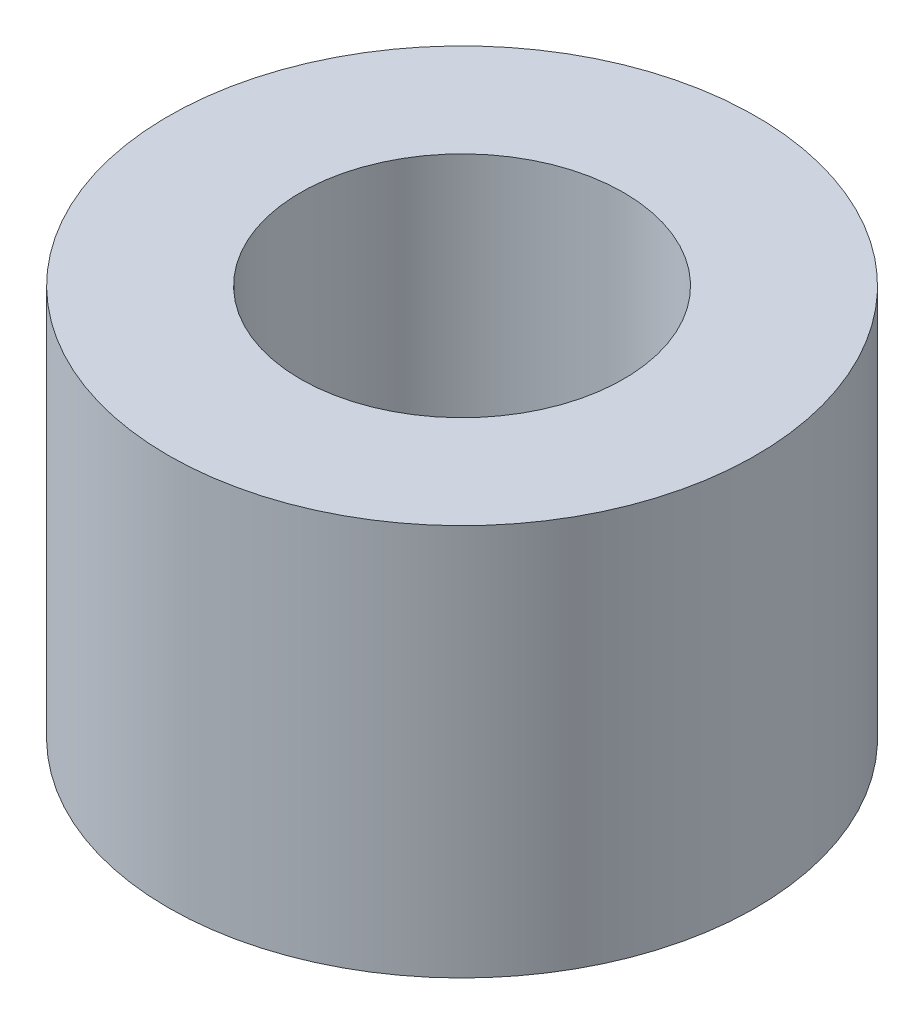
ISO-10303-21;
HEADER;
FILE_DESCRIPTION(('STEP AP214'),'2;1');
FILE_NAME('part.step','',(''),(''),'','','');
FILE_SCHEMA(('AUTOMOTIVE_DESIGN { 1 0 10303 214 1 1 1 1 }'));
ENDSEC;
DATA;
#1=APPLICATION_CONTEXT('core data for automotive mechanical design processes');
#2=APPLICATION_PROTOCOL_DEFINITION('international standard','automotive_design',2000,#1);
#3=PRODUCT_CONTEXT('',#1,'mechanical');
#4=PRODUCT('Part','Part','',(#3));
#5=PRODUCT_RELATED_PRODUCT_CATEGORY('part','',(#4));
#6=PRODUCT_DEFINITION_FORMATION('','',#4);
#7=PRODUCT_DEFINITION_CONTEXT('part definition',#1,'design');
#8=PRODUCT_DEFINITION('design','',#6,#7);
#9=PRODUCT_DEFINITION_SHAPE('','',#8);
#10=(LENGTH_UNIT() NAMED_UNIT(*) SI_UNIT(.MILLI.,.METRE.));
#11=(NAMED_UNIT(*) PLANE_ANGLE_UNIT() SI_UNIT($,.RADIAN.));
#12=(NAMED_UNIT(*) SI_UNIT($,.STERADIAN.) SOLID_ANGLE_UNIT());
#13=UNCERTAINTY_MEASURE_WITH_UNIT(LENGTH_MEASURE(1.E-05),#10,'distance_accuracy_value','');
#14=(GEOMETRIC_REPRESENTATION_CONTEXT(3) GLOBAL_UNCERTAINTY_ASSIGNED_CONTEXT((#13)) GLOBAL_UNIT_ASSIGNED_CONTEXT((#10,
#11,#12)) REPRESENTATION_CONTEXT('',''));
#15=CARTESIAN_POINT('',(0.,0.,0.));
#16=DIRECTION('',(0.,0.,1.));
#17=DIRECTION('',(1.,0.,0.));
#18=AXIS2_PLACEMENT_3D('',#15,#16,#17);
#19=CARTESIAN_POINT('',(0.,4.,0.));
#20=DIRECTION('',(0.,1.,0.));
#21=DIRECTION('',(0.,0.,1.));
#22=AXIS2_PLACEMENT_3D('',#19,#20,#21);
#23=PLANE('',#22);
#24=CARTESIAN_POINT('',(0.,4.,0.));
#25=DIRECTION('',(0.,1.,0.));
#26=DIRECTION('',(0.,0.,1.));
#27=AXIS2_PLACEMENT_3D('',#24,#25,#26);
#28=CIRCLE('',#27,3.);
#29=CARTESIAN_POINT('',(0.,4.,3.));
#30=VERTEX_POINT('',#29);
#31=EDGE_CURVE('E10',#30,#30,#28,.T.);
#32=ORIENTED_EDGE('',*,*,#31,.T.);
#33=EDGE_LOOP('',(#32));
#34=FACE_BOUND('',#33,.T.);
#35=CARTESIAN_POINT('',(0.,4.,0.));
#36=DIRECTION('',(0.,1.,0.));
#37=DIRECTION('',(0.,0.,1.));
#38=AXIS2_PLACEMENT_3D('',#35,#36,#37);
#39=CIRCLE('',#38,1.65);
#40=CARTESIAN_POINT('',(0.,4.,1.65));
#41=VERTEX_POINT('',#40);
#42=EDGE_CURVE('E51',#41,#41,#39,.T.);
#43=ORIENTED_EDGE('',*,*,#42,.F.);
#44=EDGE_LOOP('',(#43));
#45=FACE_BOUND('',#44,.T.);
#46=ADVANCED_FACE('F39',(#34,#45),#23,.T.);
#47=CARTESIAN_POINT('',(0.,0.,0.));
#48=DIRECTION('',(0.,1.,0.));
#49=DIRECTION('',(0.,0.,1.));
#50=AXIS2_PLACEMENT_3D('',#47,#48,#49);
#51=PLANE('',#50);
#52=CARTESIAN_POINT('',(0.,0.,0.));
#53=DIRECTION('',(0.,1.,0.));
#54=DIRECTION('',(0.,0.,1.));
#55=AXIS2_PLACEMENT_3D('',#52,#53,#54);
#56=CIRCLE('',#55,3.);
#57=CARTESIAN_POINT('',(0.,0.,3.));
#58=VERTEX_POINT('',#57);
#59=EDGE_CURVE('E43',#58,#58,#56,.T.);
#60=ORIENTED_EDGE('',*,*,#59,.F.);
#61=EDGE_LOOP('',(#60));
#62=FACE_BOUND('',#61,.T.);
#63=CARTESIAN_POINT('',(0.,0.,0.));
#64=DIRECTION('',(0.,1.,0.));
#65=DIRECTION('',(0.,0.,1.));
#66=AXIS2_PLACEMENT_3D('',#63,#64,#65);
#67=CIRCLE('',#66,1.65);
#68=CARTESIAN_POINT('',(0.,0.,1.65));
#69=VERTEX_POINT('',#68);
#70=EDGE_CURVE('E53',#69,#69,#67,.T.);
#71=ORIENTED_EDGE('',*,*,#70,.T.);
#72=EDGE_LOOP('',(#71));
#73=FACE_BOUND('',#72,.T.);
#74=ADVANCED_FACE('F63',(#62,#73),#51,.F.);
#75=CARTESIAN_POINT('',(0.,4.,0.));
#76=DIRECTION('',(0.,-1.,0.));
#77=DIRECTION('',(0.,0.,-1.));
#78=AXIS2_PLACEMENT_3D('',#75,#76,#77);
#79=CYLINDRICAL_SURFACE('',#78,3.);
#80=ORIENTED_EDGE('',*,*,#31,.F.);
#81=EDGE_LOOP('',(#80));
#82=FACE_BOUND('',#81,.T.);
#83=ORIENTED_EDGE('',*,*,#59,.T.);
#84=EDGE_LOOP('',(#83));
#85=FACE_BOUND('',#84,.T.);
#86=ADVANCED_FACE('F41',(#82,#85),#79,.T.);
#87=CARTESIAN_POINT('',(0.,4.,0.));
#88=DIRECTION('',(0.,-1.,0.));
#89=DIRECTION('',(0.,0.,-1.));
#90=AXIS2_PLACEMENT_3D('',#87,#88,#89);
#91=CYLINDRICAL_SURFACE('',#90,1.65);
#92=ORIENTED_EDGE('',*,*,#42,.T.);
#93=EDGE_LOOP('',(#92));
#94=FACE_BOUND('',#93,.T.);
#95=ORIENTED_EDGE('',*,*,#70,.F.);
#96=EDGE_LOOP('',(#95));
#97=FACE_BOUND('',#96,.T.);
#98=ADVANCED_FACE('F59',(#94,#97),#91,.F.);
#99=CLOSED_SHELL('',(#46,#74,#86,#98));
#100=MANIFOLD_SOLID_BREP('B2',#99);
#101=ADVANCED_BREP_SHAPE_REPRESENTATION('',(#18,#100),#14);
#102=SHAPE_DEFINITION_REPRESENTATION(#9,#101);
ENDSEC;
END-ISO-10303-21;
